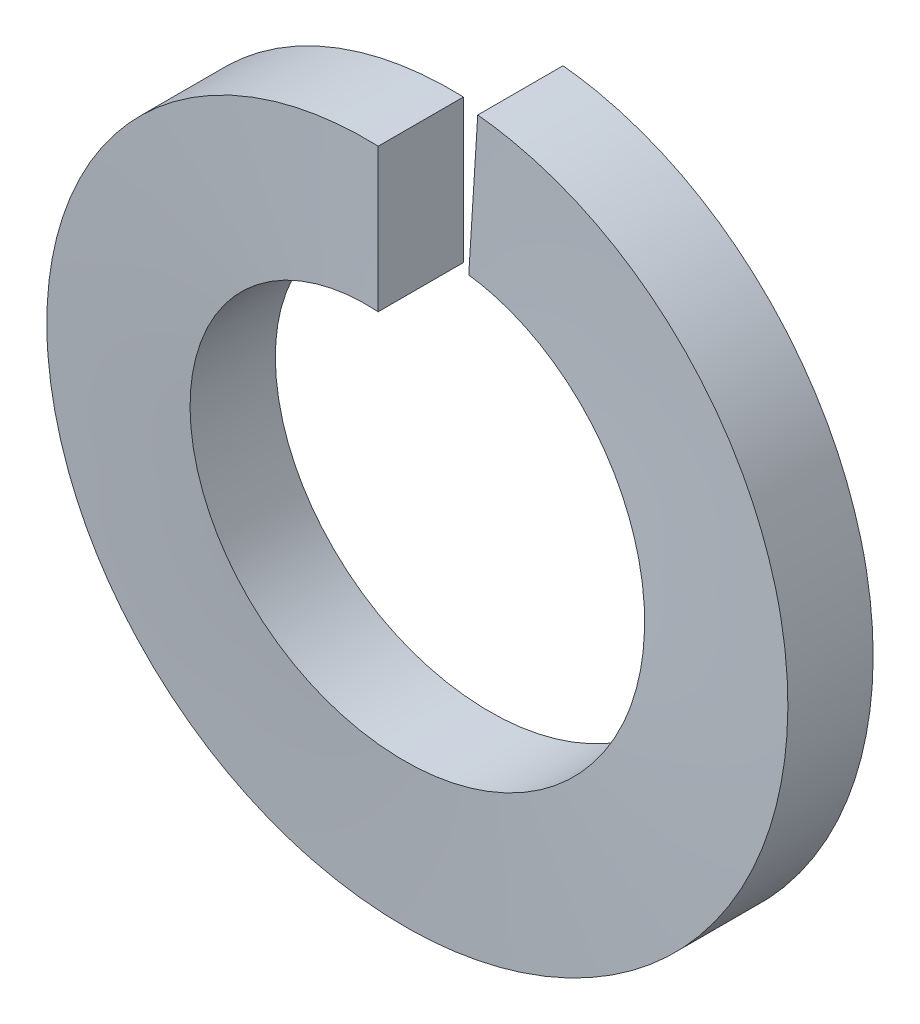
ISO-10303-21;
HEADER;
FILE_DESCRIPTION(('STEP AP214'),'2;1');
FILE_NAME('part.step','',(''),(''),'','','');
FILE_SCHEMA(('AUTOMOTIVE_DESIGN { 1 0 10303 214 1 1 1 1 }'));
ENDSEC;
DATA;
#1=APPLICATION_CONTEXT('core data for automotive mechanical design processes');
#2=APPLICATION_PROTOCOL_DEFINITION('international standard','automotive_design',2000,#1);
#3=PRODUCT_CONTEXT('',#1,'mechanical');
#4=PRODUCT('Part','Part','',(#3));
#5=PRODUCT_RELATED_PRODUCT_CATEGORY('part','',(#4));
#6=PRODUCT_DEFINITION_FORMATION('','',#4);
#7=PRODUCT_DEFINITION_CONTEXT('part definition',#1,'design');
#8=PRODUCT_DEFINITION('design','',#6,#7);
#9=PRODUCT_DEFINITION_SHAPE('','',#8);
#10=(LENGTH_UNIT() NAMED_UNIT(*) SI_UNIT(.MILLI.,.METRE.));
#11=(NAMED_UNIT(*) PLANE_ANGLE_UNIT() SI_UNIT($,.RADIAN.));
#12=(NAMED_UNIT(*) SI_UNIT($,.STERADIAN.) SOLID_ANGLE_UNIT());
#13=UNCERTAINTY_MEASURE_WITH_UNIT(LENGTH_MEASURE(1.E-05),#10,'distance_accuracy_value','');
#14=(GEOMETRIC_REPRESENTATION_CONTEXT(3) GLOBAL_UNCERTAINTY_ASSIGNED_CONTEXT((#13)) GLOBAL_UNIT_ASSIGNED_CONTEXT((#10,
#11,#12)) REPRESENTATION_CONTEXT('',''));
#15=CARTESIAN_POINT('',(0.,0.,0.));
#16=DIRECTION('',(0.,0.,1.));
#17=DIRECTION('',(1.,0.,0.));
#18=AXIS2_PLACEMENT_3D('',#15,#16,#17);
#19=CARTESIAN_POINT('',(0.,0.,0.));
#20=DIRECTION('',(1.,0.,0.));
#21=DIRECTION('',(0.,0.,-1.));
#22=AXIS2_PLACEMENT_3D('',#19,#20,#21);
#23=PLANE('',#22);
#24=DIRECTION('',(0.,0.,1.));
#25=VECTOR('',#24,1.);
#26=CARTESIAN_POINT('',(0.,9.05,0.));
#27=LINE('',#26,#25);
#28=CARTESIAN_POINT('',(0.,9.05,0.));
#29=VERTEX_POINT('',#28);
#30=CARTESIAN_POINT('',(0.,9.05,2.2));
#31=VERTEX_POINT('',#30);
#32=EDGE_CURVE('E84',#29,#31,#27,.T.);
#33=ORIENTED_EDGE('',*,*,#32,.T.);
#34=DIRECTION('',(0.,-1.,0.));
#35=VECTOR('',#34,1.);
#36=CARTESIAN_POINT('',(0.,9.05,2.2));
#37=LINE('',#36,#35);
#38=CARTESIAN_POINT('',(0.,5.35,2.2));
#39=VERTEX_POINT('',#38);
#40=EDGE_CURVE('E77',#31,#39,#37,.T.);
#41=ORIENTED_EDGE('',*,*,#40,.T.);
#42=DIRECTION('',(0.,0.,-1.));
#43=VECTOR('',#42,1.);
#44=CARTESIAN_POINT('',(0.,5.35,0.));
#45=LINE('',#44,#43);
#46=CARTESIAN_POINT('',(0.,5.35,0.));
#47=VERTEX_POINT('',#46);
#48=EDGE_CURVE('E72',#39,#47,#45,.T.);
#49=ORIENTED_EDGE('',*,*,#48,.T.);
#50=DIRECTION('',(0.,1.,0.));
#51=VECTOR('',#50,1.);
#52=CARTESIAN_POINT('',(0.,9.05,0.));
#53=LINE('',#52,#51);
#54=EDGE_CURVE('E67',#47,#29,#53,.T.);
#55=ORIENTED_EDGE('',*,*,#54,.T.);
#56=EDGE_LOOP('',(#33,#41,#49,#55));
#57=FACE_BOUND('',#56,.T.);
#58=ADVANCED_FACE('F32',(#57),#23,.T.);
#59=CARTESIAN_POINT('',(0.,0.,-2.));
#60=DIRECTION('',(0.998026728428272,-0.0627905195293,0.));
#61=DIRECTION('',(0.,0.,-1.));
#62=AXIS2_PLACEMENT_3D('',#59,#60,#61);
#63=PLANE('',#62);
#64=DIRECTION('',(0.,0.,1.));
#65=VECTOR('',#64,1.);
#66=CARTESIAN_POINT('',(0.568254201740165,9.03214189227586,-2.));
#67=LINE('',#66,#65);
#68=CARTESIAN_POINT('',(0.568254201740169,9.03214189227586,-2.));
#69=VERTEX_POINT('',#68);
#70=CARTESIAN_POINT('',(0.568254201740169,9.03214189227586,0.2));
#71=VERTEX_POINT('',#70);
#72=EDGE_CURVE('E92',#69,#71,#67,.T.);
#73=ORIENTED_EDGE('',*,*,#72,.F.);
#74=DIRECTION('',(0.0627905195293,0.998026728428272,0.));
#75=VECTOR('',#74,1.);
#76=CARTESIAN_POINT('',(0.568254201740165,9.03214189227586,-2.));
#77=LINE('',#76,#75);
#78=CARTESIAN_POINT('',(0.335929279481757,5.33944299709126,-2.));
#79=VERTEX_POINT('',#78);
#80=EDGE_CURVE('E11',#79,#69,#77,.T.);
#81=ORIENTED_EDGE('',*,*,#80,.F.);
#82=DIRECTION('',(0.,0.,-1.));
#83=VECTOR('',#82,1.);
#84=CARTESIAN_POINT('',(0.335929279481755,5.33944299709126,-2.));
#85=LINE('',#84,#83);
#86=CARTESIAN_POINT('',(0.335929279481757,5.33944299709126,0.2));
#87=VERTEX_POINT('',#86);
#88=EDGE_CURVE('E46',#87,#79,#85,.T.);
#89=ORIENTED_EDGE('',*,*,#88,.F.);
#90=DIRECTION('',(-0.0627905195293,-0.998026728428272,0.));
#91=VECTOR('',#90,1.);
#92=CARTESIAN_POINT('',(0.568254201740165,9.03214189227586,0.2));
#93=LINE('',#92,#91);
#94=EDGE_CURVE('E55',#71,#87,#93,.T.);
#95=ORIENTED_EDGE('',*,*,#94,.F.);
#96=EDGE_LOOP('',(#73,#81,#89,#95));
#97=FACE_BOUND('',#96,.T.);
#98=ADVANCED_FACE('F138',(#97),#63,.F.);
#99=CARTESIAN_POINT('',(0.,0.,0.));
#100=DIRECTION('',(0.,0.,-1.));
#101=DIRECTION('',(-1.,0.,0.));
#102=AXIS2_PLACEMENT_3D('',#99,#100,#101);
#103=CYLINDRICAL_SURFACE('',#102,9.05);
#104=CARTESIAN_POINT('',(0.,9.05,2.2));
#105=CARTESIAN_POINT('',(-2.90912220299988,9.05,2.1));
#106=CARTESIAN_POINT('',(-5.27334884100062,7.35488218811949,2.));
#107=CARTESIAN_POINT('',(-7.63757547900137,5.65976437623899,1.9));
#108=CARTESIAN_POINT('',(-8.57123966020244,2.90453966875522,1.8));
#109=CARTESIAN_POINT('',(-9.50490384140352,0.149314961271461,1.7));
#110=CARTESIAN_POINT('',(-8.65824406660741,-2.63387730979589,1.6));
#111=CARTESIAN_POINT('',(-7.81158429181129,-5.41706958086325,1.5));
#112=CARTESIAN_POINT('',(-5.50176919413614,-7.18561310776294,1.4));
#113=CARTESIAN_POINT('',(-3.19195409646099,-8.95415663466263,1.3));
#114=CARTESIAN_POINT('',(-0.284267369657004,-9.04553437130987,1.2));
#115=CARTESIAN_POINT('',(2.62341935714698,-9.13691210795712,1.1));
#116=CARTESIAN_POINT('',(5.03972432921816,-7.51689288772207,1.));
#117=CARTESIAN_POINT('',(7.45602930128933,-5.89687366748702,0.9));
#118=CARTESIAN_POINT('',(8.47577647507117,-3.17233559773082,0.8));
#119=CARTESIAN_POINT('',(9.49552364885301,-0.447797527974619,0.7));
#120=CARTESIAN_POINT('',(8.7367038314411,2.36061563192365,0.6));
#121=CARTESIAN_POINT('',(7.97788401402921,5.16902879182193,0.5));
#122=CARTESIAN_POINT('',(5.7247599653137,7.0092526947986,0.4));
#123=CARTESIAN_POINT('',(3.47163591659818,8.84947659777528,0.3));
#124=CARTESIAN_POINT('',(0.568254201740173,9.03214189227586,0.2));
#125=(BOUNDED_CURVE() B_SPLINE_CURVE(2,(#104,#105,#106,#107,#108,#109,#110,#111,#112,#113,#114,
#115,#116,#117,#118,#119,#120,#121,#122,#123,#124),.UNSPECIFIED.,.F.,
.F.) B_SPLINE_CURVE_WITH_KNOTS((3,2,2,2,2,2,2,2,2,2,3),(0.,0.1,0.2,0.3,0.4,0.5,0.6,0.7,0.8,0.9,
1.),.UNSPECIFIED.) CURVE() GEOMETRIC_REPRESENTATION_ITEM() RATIONAL_B_SPLINE_CURVE((1.,
0.952022626945676,1.,0.952022626945676,1.,0.952022626945676,1.,0.952022626945676,1.,
0.952022626945676,1.,0.952022626945676,1.,0.952022626945676,1.,0.952022626945676,1.,
0.952022626945676,1.,0.952022626945676,1.)) REPRESENTATION_ITEM(''));
#126=EDGE_CURVE('E87',#31,#71,#125,.T.);
#127=ORIENTED_EDGE('',*,*,#126,.F.);
#128=ORIENTED_EDGE('',*,*,#32,.F.);
#129=CARTESIAN_POINT('',(0.,9.05,0.));
#130=CARTESIAN_POINT('',(-2.90912220299988,9.05,-0.1));
#131=CARTESIAN_POINT('',(-5.27334884100062,7.35488218811949,-0.2));
#132=CARTESIAN_POINT('',(-7.63757547900137,5.65976437623899,-0.3));
#133=CARTESIAN_POINT('',(-8.57123966020244,2.90453966875522,-0.4));
#134=CARTESIAN_POINT('',(-9.50490384140352,0.149314961271461,-0.5));
#135=CARTESIAN_POINT('',(-8.65824406660741,-2.63387730979589,-0.6));
#136=CARTESIAN_POINT('',(-7.81158429181129,-5.41706958086325,-0.7));
#137=CARTESIAN_POINT('',(-5.50176919413614,-7.18561310776294,-0.8));
#138=CARTESIAN_POINT('',(-3.19195409646099,-8.95415663466263,-0.9));
#139=CARTESIAN_POINT('',(-0.284267369657004,-9.04553437130987,-1.));
#140=CARTESIAN_POINT('',(2.62341935714698,-9.13691210795712,-1.1));
#141=CARTESIAN_POINT('',(5.03972432921816,-7.51689288772207,-1.2));
#142=CARTESIAN_POINT('',(7.45602930128933,-5.89687366748702,-1.3));
#143=CARTESIAN_POINT('',(8.47577647507117,-3.17233559773082,-1.4));
#144=CARTESIAN_POINT('',(9.49552364885301,-0.447797527974619,-1.5));
#145=CARTESIAN_POINT('',(8.7367038314411,2.36061563192365,-1.6));
#146=CARTESIAN_POINT('',(7.97788401402921,5.16902879182193,-1.7));
#147=CARTESIAN_POINT('',(5.7247599653137,7.0092526947986,-1.8));
#148=CARTESIAN_POINT('',(3.47163591659818,8.84947659777528,-1.9));
#149=CARTESIAN_POINT('',(0.568254201740173,9.03214189227586,-2.));
#150=(BOUNDED_CURVE() B_SPLINE_CURVE(2,(#129,#130,#131,#132,#133,#134,#135,#136,#137,#138,#139,
#140,#141,#142,#143,#144,#145,#146,#147,#148,#149),.UNSPECIFIED.,.F.,
.F.) B_SPLINE_CURVE_WITH_KNOTS((3,2,2,2,2,2,2,2,2,2,3),(0.,0.1,0.2,0.3,0.4,0.5,0.6,0.7,0.8,0.9,
1.),.UNSPECIFIED.) CURVE() GEOMETRIC_REPRESENTATION_ITEM() RATIONAL_B_SPLINE_CURVE((1.,
0.952022626945676,1.,0.952022626945676,1.,0.952022626945676,1.,0.952022626945676,1.,
0.952022626945676,1.,0.952022626945676,1.,0.952022626945676,1.,0.952022626945676,1.,
0.952022626945676,1.,0.952022626945676,1.)) REPRESENTATION_ITEM(''));
#151=EDGE_CURVE('E86',#29,#69,#150,.T.);
#152=ORIENTED_EDGE('',*,*,#151,.T.);
#153=ORIENTED_EDGE('',*,*,#72,.T.);
#154=EDGE_LOOP('',(#127,#128,#152,#153));
#155=FACE_BOUND('',#154,.T.);
#156=ADVANCED_FACE('F85',(#155),#103,.T.);
#157=CARTESIAN_POINT('',(0.,9.05,2.2));
#158=CARTESIAN_POINT('',(-2.90912220299988,9.05,2.1));
#159=CARTESIAN_POINT('',(-5.27334884100062,7.35488218811949,2.));
#160=CARTESIAN_POINT('',(-7.63757547900137,5.65976437623899,1.9));
#161=CARTESIAN_POINT('',(-8.57123966020244,2.90453966875522,1.8));
#162=CARTESIAN_POINT('',(-9.50490384140352,0.149314961271461,1.7));
#163=CARTESIAN_POINT('',(-8.65824406660741,-2.63387730979589,1.6));
#164=CARTESIAN_POINT('',(-7.81158429181129,-5.41706958086325,1.5));
#165=CARTESIAN_POINT('',(-5.50176919413614,-7.18561310776294,1.4));
#166=CARTESIAN_POINT('',(-3.19195409646099,-8.95415663466263,1.3));
#167=CARTESIAN_POINT('',(-0.284267369657004,-9.04553437130987,1.2));
#168=CARTESIAN_POINT('',(2.62341935714698,-9.13691210795712,1.1));
#169=CARTESIAN_POINT('',(5.03972432921816,-7.51689288772207,1.));
#170=CARTESIAN_POINT('',(7.45602930128933,-5.89687366748702,0.9));
#171=CARTESIAN_POINT('',(8.47577647507117,-3.17233559773082,0.8));
#172=CARTESIAN_POINT('',(9.49552364885301,-0.447797527974619,0.7));
#173=CARTESIAN_POINT('',(8.7367038314411,2.36061563192365,0.6));
#174=CARTESIAN_POINT('',(7.97788401402921,5.16902879182193,0.5));
#175=CARTESIAN_POINT('',(5.7247599653137,7.0092526947986,0.4));
#176=CARTESIAN_POINT('',(3.47163591659818,8.84947659777528,0.3));
#177=CARTESIAN_POINT('',(0.568254201740173,9.03214189227586,0.2));
#178=CARTESIAN_POINT('',(0.,5.35,2.2));
#179=CARTESIAN_POINT('',(-1.71975732442534,5.35,2.1));
#180=CARTESIAN_POINT('',(-3.11739406622689,4.34791377971705,2.));
#181=CARTESIAN_POINT('',(-4.51503080802843,3.3458275594341,1.9));
#182=CARTESIAN_POINT('',(-5.06697593172189,1.71704831246856,1.8));
#183=CARTESIAN_POINT('',(-5.61892105541534,0.0882690655030187,1.7));
#184=CARTESIAN_POINT('',(-5.11840947583974,-1.55704349253127,1.6));
#185=CARTESIAN_POINT('',(-4.61789789626414,-3.20235605056557,1.5));
#186=CARTESIAN_POINT('',(-3.25242709266612,-4.24784863276594,1.4));
#187=CARTESIAN_POINT('',(-1.8869562890681,-5.29334121496631,1.3));
#188=CARTESIAN_POINT('',(-0.168047561067953,-5.34736009795667,1.2));
#189=CARTESIAN_POINT('',(1.55086116693219,-5.40137898094703,1.1));
#190=CARTESIAN_POINT('',(2.97928454821184,-4.44368806069758,1.));
#191=CARTESIAN_POINT('',(4.40770792949148,-3.48599714044813,0.9));
#192=CARTESIAN_POINT('',(5.01054189410285,-1.87535861302319,0.8));
#193=CARTESIAN_POINT('',(5.61337585871421,-0.264720085598256,0.7));
#194=CARTESIAN_POINT('',(5.164791767758,1.395502058651,0.6));
#195=CARTESIAN_POINT('',(4.7162076768018,3.05572420290026,0.5));
#196=CARTESIAN_POINT('',(3.38425036623517,4.14359137206326,0.4));
#197=CARTESIAN_POINT('',(2.05229305566854,5.23145854122627,0.3));
#198=CARTESIAN_POINT('',(0.33592927948176,5.33944299709126,0.2));
#199=(BOUNDED_SURFACE() B_SPLINE_SURFACE(1,2,((#157,#158,#159,#160,#161,#162,#163,#164,#165,
#166,#167,#168,#169,#170,#171,#172,#173,#174,#175,#176,#177),(#178,#179,#180,#181,#182,#183,
#184,#185,#186,#187,#188,#189,#190,#191,#192,#193,#194,#195,#196,#197,#198)),.UNSPECIFIED.,.F.,
.F.,.F.) B_SPLINE_SURFACE_WITH_KNOTS((2,2),(3,2,2,2,2,2,2,2,2,2,3),(0.,1.),(0.,0.1,0.2,0.3,0.4,
0.5,0.6,0.7,0.8,0.9,1.),
.UNSPECIFIED.) GEOMETRIC_REPRESENTATION_ITEM() RATIONAL_B_SPLINE_SURFACE(((1.,0.952022626945676,
1.,0.952022626945676,1.,0.952022626945676,1.,0.952022626945676,1.,0.952022626945676,1.,
0.952022626945676,1.,0.952022626945676,1.,0.952022626945676,1.,0.952022626945676,1.,
0.952022626945676,1.),(1.,0.952022626945676,1.,0.952022626945676,1.,0.952022626945676,1.,
0.952022626945676,1.,0.952022626945676,1.,0.952022626945676,1.,0.952022626945676,1.,
0.952022626945676,1.,0.952022626945676,1.,0.952022626945676,1.))) REPRESENTATION_ITEM('') SURFACE());
#200=CARTESIAN_POINT('',(0.,5.35,2.2));
#201=CARTESIAN_POINT('',(-1.71975732442534,5.35,2.1));
#202=CARTESIAN_POINT('',(-3.11739406622689,4.34791377971705,2.));
#203=CARTESIAN_POINT('',(-4.51503080802843,3.3458275594341,1.9));
#204=CARTESIAN_POINT('',(-5.06697593172189,1.71704831246856,1.8));
#205=CARTESIAN_POINT('',(-5.61892105541534,0.0882690655030187,1.7));
#206=CARTESIAN_POINT('',(-5.11840947583974,-1.55704349253127,1.6));
#207=CARTESIAN_POINT('',(-4.61789789626414,-3.20235605056557,1.5));
#208=CARTESIAN_POINT('',(-3.25242709266612,-4.24784863276594,1.4));
#209=CARTESIAN_POINT('',(-1.8869562890681,-5.29334121496631,1.3));
#210=CARTESIAN_POINT('',(-0.168047561067953,-5.34736009795667,1.2));
#211=CARTESIAN_POINT('',(1.55086116693219,-5.40137898094703,1.1));
#212=CARTESIAN_POINT('',(2.97928454821184,-4.44368806069758,1.));
#213=CARTESIAN_POINT('',(4.40770792949148,-3.48599714044813,0.9));
#214=CARTESIAN_POINT('',(5.01054189410285,-1.87535861302319,0.8));
#215=CARTESIAN_POINT('',(5.61337585871421,-0.264720085598256,0.7));
#216=CARTESIAN_POINT('',(5.164791767758,1.395502058651,0.6));
#217=CARTESIAN_POINT('',(4.7162076768018,3.05572420290026,0.5));
#218=CARTESIAN_POINT('',(3.38425036623517,4.14359137206326,0.4));
#219=CARTESIAN_POINT('',(2.05229305566854,5.23145854122627,0.3));
#220=CARTESIAN_POINT('',(0.33592927948176,5.33944299709126,0.2));
#221=(BOUNDED_CURVE() B_SPLINE_CURVE(2,(#200,#201,#202,#203,#204,#205,#206,#207,#208,#209,#210,
#211,#212,#213,#214,#215,#216,#217,#218,#219,#220),.UNSPECIFIED.,.F.,
.F.) B_SPLINE_CURVE_WITH_KNOTS((3,2,2,2,2,2,2,2,2,2,3),(0.,0.1,0.2,0.3,0.4,0.5,0.6,0.7,0.8,0.9,
1.),.UNSPECIFIED.) CURVE() GEOMETRIC_REPRESENTATION_ITEM() RATIONAL_B_SPLINE_CURVE((1.,
0.952022626945676,1.,0.952022626945676,1.,0.952022626945676,1.,0.952022626945676,1.,
0.952022626945676,1.,0.952022626945676,1.,0.952022626945676,1.,0.952022626945676,1.,
0.952022626945676,1.,0.952022626945676,1.)) REPRESENTATION_ITEM(''));
#222=EDGE_CURVE('E107',#39,#87,#221,.T.);
#223=ORIENTED_EDGE('',*,*,#222,.F.);
#224=ORIENTED_EDGE('',*,*,#40,.F.);
#225=ORIENTED_EDGE('',*,*,#126,.T.);
#226=ORIENTED_EDGE('',*,*,#94,.T.);
#227=EDGE_LOOP('',(#223,#224,#225,#226));
#228=FACE_BOUND('',#227,.T.);
#229=ADVANCED_FACE('F125',(#228),#199,.F.);
#230=CARTESIAN_POINT('',(0.,0.,0.));
#231=DIRECTION('',(0.,0.,-1.));
#232=DIRECTION('',(-1.,0.,0.));
#233=AXIS2_PLACEMENT_3D('',#230,#231,#232);
#234=CYLINDRICAL_SURFACE('',#233,5.35);
#235=CARTESIAN_POINT('',(0.,5.35,0.));
#236=CARTESIAN_POINT('',(-1.71975732442534,5.35,-0.1));
#237=CARTESIAN_POINT('',(-3.11739406622689,4.34791377971705,-0.2));
#238=CARTESIAN_POINT('',(-4.51503080802843,3.3458275594341,-0.3));
#239=CARTESIAN_POINT('',(-5.06697593172189,1.71704831246856,-0.4));
#240=CARTESIAN_POINT('',(-5.61892105541534,0.0882690655030187,-0.5));
#241=CARTESIAN_POINT('',(-5.11840947583974,-1.55704349253127,-0.6));
#242=CARTESIAN_POINT('',(-4.61789789626414,-3.20235605056557,-0.7));
#243=CARTESIAN_POINT('',(-3.25242709266612,-4.24784863276594,-0.8));
#244=CARTESIAN_POINT('',(-1.8869562890681,-5.29334121496631,-0.9));
#245=CARTESIAN_POINT('',(-0.168047561067953,-5.34736009795667,-1.));
#246=CARTESIAN_POINT('',(1.55086116693219,-5.40137898094703,-1.1));
#247=CARTESIAN_POINT('',(2.97928454821184,-4.44368806069758,-1.2));
#248=CARTESIAN_POINT('',(4.40770792949148,-3.48599714044813,-1.3));
#249=CARTESIAN_POINT('',(5.01054189410285,-1.87535861302319,-1.4));
#250=CARTESIAN_POINT('',(5.61337585871421,-0.264720085598256,-1.5));
#251=CARTESIAN_POINT('',(5.164791767758,1.395502058651,-1.6));
#252=CARTESIAN_POINT('',(4.7162076768018,3.05572420290026,-1.7));
#253=CARTESIAN_POINT('',(3.38425036623517,4.14359137206326,-1.8));
#254=CARTESIAN_POINT('',(2.05229305566854,5.23145854122627,-1.9));
#255=CARTESIAN_POINT('',(0.33592927948176,5.33944299709126,-2.));
#256=(BOUNDED_CURVE() B_SPLINE_CURVE(2,(#235,#236,#237,#238,#239,#240,#241,#242,#243,#244,#245,
#246,#247,#248,#249,#250,#251,#252,#253,#254,#255),.UNSPECIFIED.,.F.,
.F.) B_SPLINE_CURVE_WITH_KNOTS((3,2,2,2,2,2,2,2,2,2,3),(0.,0.1,0.2,0.3,0.4,0.5,0.6,0.7,0.8,0.9,
1.),.UNSPECIFIED.) CURVE() GEOMETRIC_REPRESENTATION_ITEM() RATIONAL_B_SPLINE_CURVE((1.,
0.952022626945676,1.,0.952022626945676,1.,0.952022626945676,1.,0.952022626945676,1.,
0.952022626945676,1.,0.952022626945676,1.,0.952022626945676,1.,0.952022626945676,1.,
0.952022626945676,1.,0.952022626945676,1.)) REPRESENTATION_ITEM(''));
#257=EDGE_CURVE('E39',#47,#79,#256,.T.);
#258=ORIENTED_EDGE('',*,*,#257,.F.);
#259=ORIENTED_EDGE('',*,*,#48,.F.);
#260=ORIENTED_EDGE('',*,*,#222,.T.);
#261=ORIENTED_EDGE('',*,*,#88,.T.);
#262=EDGE_LOOP('',(#258,#259,#260,#261));
#263=FACE_BOUND('',#262,.T.);
#264=ADVANCED_FACE('F123',(#263),#234,.F.);
#265=CARTESIAN_POINT('',(0.,5.35,0.));
#266=CARTESIAN_POINT('',(-1.71975732442534,5.35,-0.1));
#267=CARTESIAN_POINT('',(-3.11739406622689,4.34791377971705,-0.2));
#268=CARTESIAN_POINT('',(-4.51503080802843,3.3458275594341,-0.3));
#269=CARTESIAN_POINT('',(-5.06697593172189,1.71704831246856,-0.4));
#270=CARTESIAN_POINT('',(-5.61892105541534,0.0882690655030187,-0.5));
#271=CARTESIAN_POINT('',(-5.11840947583974,-1.55704349253127,-0.6));
#272=CARTESIAN_POINT('',(-4.61789789626414,-3.20235605056557,-0.7));
#273=CARTESIAN_POINT('',(-3.25242709266612,-4.24784863276594,-0.8));
#274=CARTESIAN_POINT('',(-1.8869562890681,-5.29334121496631,-0.9));
#275=CARTESIAN_POINT('',(-0.168047561067953,-5.34736009795667,-1.));
#276=CARTESIAN_POINT('',(1.55086116693219,-5.40137898094703,-1.1));
#277=CARTESIAN_POINT('',(2.97928454821184,-4.44368806069758,-1.2));
#278=CARTESIAN_POINT('',(4.40770792949148,-3.48599714044813,-1.3));
#279=CARTESIAN_POINT('',(5.01054189410285,-1.87535861302319,-1.4));
#280=CARTESIAN_POINT('',(5.61337585871421,-0.264720085598256,-1.5));
#281=CARTESIAN_POINT('',(5.164791767758,1.395502058651,-1.6));
#282=CARTESIAN_POINT('',(4.7162076768018,3.05572420290026,-1.7));
#283=CARTESIAN_POINT('',(3.38425036623517,4.14359137206326,-1.8));
#284=CARTESIAN_POINT('',(2.05229305566854,5.23145854122627,-1.9));
#285=CARTESIAN_POINT('',(0.33592927948176,5.33944299709126,-2.));
#286=CARTESIAN_POINT('',(0.,9.05,0.));
#287=CARTESIAN_POINT('',(-2.90912220299988,9.05,-0.1));
#288=CARTESIAN_POINT('',(-5.27334884100062,7.35488218811949,-0.2));
#289=CARTESIAN_POINT('',(-7.63757547900137,5.65976437623899,-0.3));
#290=CARTESIAN_POINT('',(-8.57123966020244,2.90453966875522,-0.4));
#291=CARTESIAN_POINT('',(-9.50490384140352,0.149314961271461,-0.5));
#292=CARTESIAN_POINT('',(-8.65824406660741,-2.63387730979589,-0.6));
#293=CARTESIAN_POINT('',(-7.81158429181129,-5.41706958086325,-0.7));
#294=CARTESIAN_POINT('',(-5.50176919413614,-7.18561310776294,-0.8));
#295=CARTESIAN_POINT('',(-3.19195409646099,-8.95415663466263,-0.9));
#296=CARTESIAN_POINT('',(-0.284267369657004,-9.04553437130987,-1.));
#297=CARTESIAN_POINT('',(2.62341935714698,-9.13691210795712,-1.1));
#298=CARTESIAN_POINT('',(5.03972432921816,-7.51689288772207,-1.2));
#299=CARTESIAN_POINT('',(7.45602930128933,-5.89687366748702,-1.3));
#300=CARTESIAN_POINT('',(8.47577647507117,-3.17233559773082,-1.4));
#301=CARTESIAN_POINT('',(9.49552364885301,-0.447797527974619,-1.5));
#302=CARTESIAN_POINT('',(8.7367038314411,2.36061563192365,-1.6));
#303=CARTESIAN_POINT('',(7.97788401402921,5.16902879182193,-1.7));
#304=CARTESIAN_POINT('',(5.7247599653137,7.0092526947986,-1.8));
#305=CARTESIAN_POINT('',(3.47163591659818,8.84947659777528,-1.9));
#306=CARTESIAN_POINT('',(0.568254201740173,9.03214189227586,-2.));
#307=(BOUNDED_SURFACE() B_SPLINE_SURFACE(1,2,((#265,#266,#267,#268,#269,#270,#271,#272,#273,
#274,#275,#276,#277,#278,#279,#280,#281,#282,#283,#284,#285),(#286,#287,#288,#289,#290,#291,
#292,#293,#294,#295,#296,#297,#298,#299,#300,#301,#302,#303,#304,#305,#306)),.UNSPECIFIED.,.F.,
.F.,.F.) B_SPLINE_SURFACE_WITH_KNOTS((2,2),(3,2,2,2,2,2,2,2,2,2,3),(0.,1.),(0.,0.1,0.2,0.3,0.4,
0.5,0.6,0.7,0.8,0.9,1.),
.UNSPECIFIED.) GEOMETRIC_REPRESENTATION_ITEM() RATIONAL_B_SPLINE_SURFACE(((1.,0.952022626945676,
1.,0.952022626945676,1.,0.952022626945676,1.,0.952022626945676,1.,0.952022626945676,1.,
0.952022626945676,1.,0.952022626945676,1.,0.952022626945676,1.,0.952022626945676,1.,
0.952022626945676,1.),(1.,0.952022626945676,1.,0.952022626945676,1.,0.952022626945676,1.,
0.952022626945676,1.,0.952022626945676,1.,0.952022626945676,1.,0.952022626945676,1.,
0.952022626945676,1.,0.952022626945676,1.,0.952022626945676,1.))) REPRESENTATION_ITEM('') SURFACE());
#308=ORIENTED_EDGE('',*,*,#80,.T.);
#309=ORIENTED_EDGE('',*,*,#151,.F.);
#310=ORIENTED_EDGE('',*,*,#54,.F.);
#311=ORIENTED_EDGE('',*,*,#257,.T.);
#312=EDGE_LOOP('',(#308,#309,#310,#311));
#313=FACE_BOUND('',#312,.T.);
#314=ADVANCED_FACE('F90',(#313),#307,.F.);
#315=CLOSED_SHELL('',(#58,#98,#156,#229,#264,#314));
#316=MANIFOLD_SOLID_BREP('B2',#315);
#317=ADVANCED_BREP_SHAPE_REPRESENTATION('',(#18,#316),#14);
#318=SHAPE_DEFINITION_REPRESENTATION(#9,#317);
ENDSEC;
END-ISO-10303-21;
